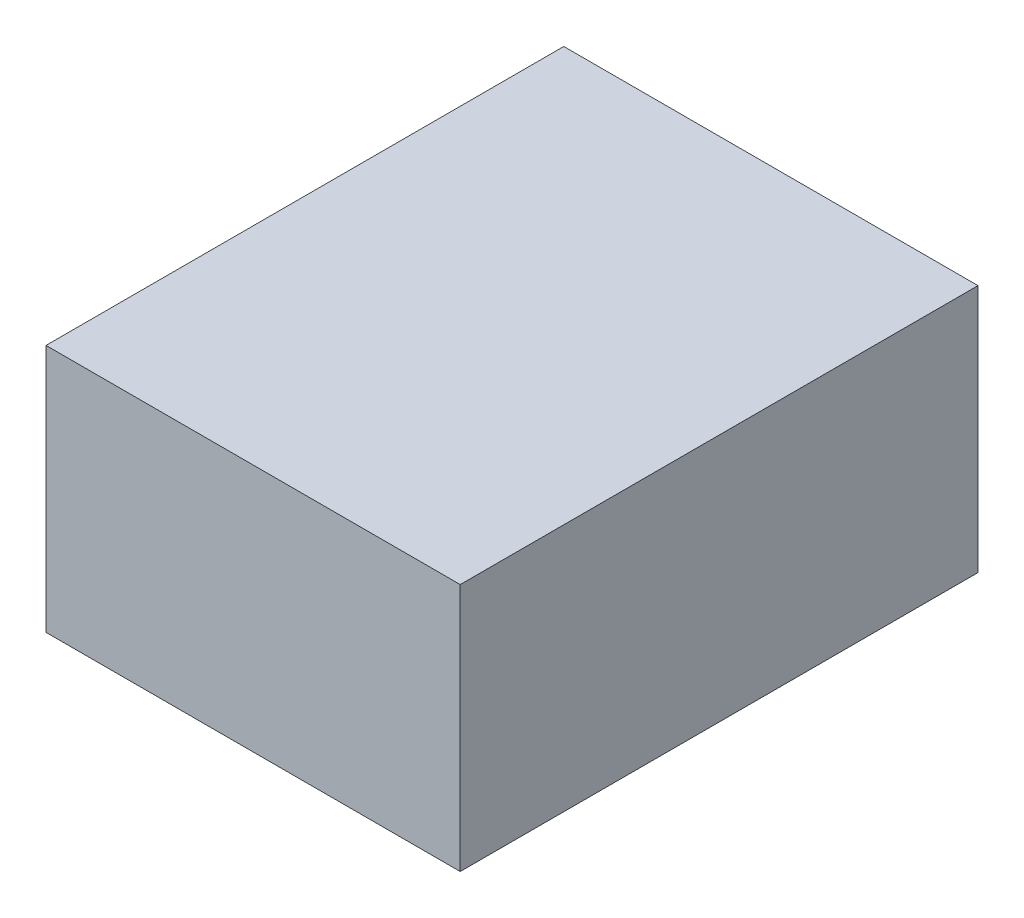
ISO-10303-21;
HEADER;
FILE_DESCRIPTION(('STEP AP214'),'2;1');
FILE_NAME('part.step','',(''),(''),'','','');
FILE_SCHEMA(('AUTOMOTIVE_DESIGN { 1 0 10303 214 1 1 1 1 }'));
ENDSEC;
DATA;
#1=APPLICATION_CONTEXT('core data for automotive mechanical design processes');
#2=APPLICATION_PROTOCOL_DEFINITION('international standard','automotive_design',2000,#1);
#3=PRODUCT_CONTEXT('',#1,'mechanical');
#4=PRODUCT('Part','Part','',(#3));
#5=PRODUCT_RELATED_PRODUCT_CATEGORY('part','',(#4));
#6=PRODUCT_DEFINITION_FORMATION('','',#4);
#7=PRODUCT_DEFINITION_CONTEXT('part definition',#1,'design');
#8=PRODUCT_DEFINITION('design','',#6,#7);
#9=PRODUCT_DEFINITION_SHAPE('','',#8);
#10=(LENGTH_UNIT() NAMED_UNIT(*) SI_UNIT(.MILLI.,.METRE.));
#11=(NAMED_UNIT(*) PLANE_ANGLE_UNIT() SI_UNIT($,.RADIAN.));
#12=(NAMED_UNIT(*) SI_UNIT($,.STERADIAN.) SOLID_ANGLE_UNIT());
#13=UNCERTAINTY_MEASURE_WITH_UNIT(LENGTH_MEASURE(1.E-05),#10,'distance_accuracy_value','');
#14=(GEOMETRIC_REPRESENTATION_CONTEXT(3) GLOBAL_UNCERTAINTY_ASSIGNED_CONTEXT((#13)) GLOBAL_UNIT_ASSIGNED_CONTEXT((#10,
#11,#12)) REPRESENTATION_CONTEXT('',''));
#15=CARTESIAN_POINT('',(0.,0.,0.));
#16=DIRECTION('',(0.,0.,1.));
#17=DIRECTION('',(1.,0.,0.));
#18=AXIS2_PLACEMENT_3D('',#15,#16,#17);
#19=CARTESIAN_POINT('',(1.,1.2,-1.25));
#20=DIRECTION('',(-1.,0.,0.));
#21=DIRECTION('',(0.,0.,1.));
#22=AXIS2_PLACEMENT_3D('',#19,#20,#21);
#23=PLANE('',#22);
#24=DIRECTION('',(0.,0.,-1.));
#25=VECTOR('',#24,1.);
#26=CARTESIAN_POINT('',(1.,0.,-1.25));
#27=LINE('',#26,#25);
#28=CARTESIAN_POINT('',(1.,0.,1.25));
#29=VERTEX_POINT('',#28);
#30=CARTESIAN_POINT('',(1.,0.,-1.25));
#31=VERTEX_POINT('',#30);
#32=EDGE_CURVE('E97',#29,#31,#27,.T.);
#33=ORIENTED_EDGE('',*,*,#32,.T.);
#34=DIRECTION('',(0.,-1.,0.));
#35=VECTOR('',#34,1.);
#36=CARTESIAN_POINT('',(1.,1.2,-1.25));
#37=LINE('',#36,#35);
#38=CARTESIAN_POINT('',(1.,1.2,-1.25));
#39=VERTEX_POINT('',#38);
#40=EDGE_CURVE('E11',#39,#31,#37,.T.);
#41=ORIENTED_EDGE('',*,*,#40,.F.);
#42=DIRECTION('',(0.,0.,-1.));
#43=VECTOR('',#42,1.);
#44=CARTESIAN_POINT('',(1.,1.2,-1.25));
#45=LINE('',#44,#43);
#46=CARTESIAN_POINT('',(1.,1.2,1.25));
#47=VERTEX_POINT('',#46);
#48=EDGE_CURVE('E85',#47,#39,#45,.T.);
#49=ORIENTED_EDGE('',*,*,#48,.F.);
#50=DIRECTION('',(0.,-1.,0.));
#51=VECTOR('',#50,1.);
#52=CARTESIAN_POINT('',(1.,1.2,1.25));
#53=LINE('',#52,#51);
#54=EDGE_CURVE('E93',#47,#29,#53,.T.);
#55=ORIENTED_EDGE('',*,*,#54,.T.);
#56=EDGE_LOOP('',(#33,#41,#49,#55));
#57=FACE_BOUND('',#56,.T.);
#58=ADVANCED_FACE('F34',(#57),#23,.F.);
#59=CARTESIAN_POINT('',(-1.,1.2,-1.25));
#60=DIRECTION('',(0.,0.,1.));
#61=DIRECTION('',(1.,0.,0.));
#62=AXIS2_PLACEMENT_3D('',#59,#60,#61);
#63=PLANE('',#62);
#64=DIRECTION('',(-1.,0.,0.));
#65=VECTOR('',#64,1.);
#66=CARTESIAN_POINT('',(-1.,0.,-1.25));
#67=LINE('',#66,#65);
#68=CARTESIAN_POINT('',(-1.,0.,-1.25));
#69=VERTEX_POINT('',#68);
#70=EDGE_CURVE('E89',#31,#69,#67,.T.);
#71=ORIENTED_EDGE('',*,*,#70,.T.);
#72=DIRECTION('',(0.,-1.,0.));
#73=VECTOR('',#72,1.);
#74=CARTESIAN_POINT('',(-1.,1.2,-1.25));
#75=LINE('',#74,#73);
#76=CARTESIAN_POINT('',(-1.,1.2,-1.25));
#77=VERTEX_POINT('',#76);
#78=EDGE_CURVE('E42',#77,#69,#75,.T.);
#79=ORIENTED_EDGE('',*,*,#78,.F.);
#80=DIRECTION('',(-1.,0.,0.));
#81=VECTOR('',#80,1.);
#82=CARTESIAN_POINT('',(-1.,1.2,-1.25));
#83=LINE('',#82,#81);
#84=EDGE_CURVE('E80',#39,#77,#83,.T.);
#85=ORIENTED_EDGE('',*,*,#84,.F.);
#86=ORIENTED_EDGE('',*,*,#40,.T.);
#87=EDGE_LOOP('',(#71,#79,#85,#86));
#88=FACE_BOUND('',#87,.T.);
#89=ADVANCED_FACE('F88',(#88),#63,.F.);
#90=CARTESIAN_POINT('',(-1.,1.2,-1.25));
#91=DIRECTION('',(1.,0.,0.));
#92=DIRECTION('',(0.,0.,-1.));
#93=AXIS2_PLACEMENT_3D('',#90,#91,#92);
#94=PLANE('',#93);
#95=DIRECTION('',(0.,0.,1.));
#96=VECTOR('',#95,1.);
#97=CARTESIAN_POINT('',(-1.,0.,-1.25));
#98=LINE('',#97,#96);
#99=CARTESIAN_POINT('',(-1.,0.,1.25));
#100=VERTEX_POINT('',#99);
#101=EDGE_CURVE('E67',#69,#100,#98,.T.);
#102=ORIENTED_EDGE('',*,*,#101,.T.);
#103=DIRECTION('',(0.,-1.,0.));
#104=VECTOR('',#103,1.);
#105=CARTESIAN_POINT('',(-1.,1.2,1.25));
#106=LINE('',#105,#104);
#107=CARTESIAN_POINT('',(-1.,1.2,1.25));
#108=VERTEX_POINT('',#107);
#109=EDGE_CURVE('E90',#108,#100,#106,.T.);
#110=ORIENTED_EDGE('',*,*,#109,.F.);
#111=DIRECTION('',(0.,0.,1.));
#112=VECTOR('',#111,1.);
#113=CARTESIAN_POINT('',(-1.,1.2,-1.25));
#114=LINE('',#113,#112);
#115=EDGE_CURVE('E83',#77,#108,#114,.T.);
#116=ORIENTED_EDGE('',*,*,#115,.F.);
#117=ORIENTED_EDGE('',*,*,#78,.T.);
#118=EDGE_LOOP('',(#102,#110,#116,#117));
#119=FACE_BOUND('',#118,.T.);
#120=ADVANCED_FACE('F91',(#119),#94,.F.);
#121=CARTESIAN_POINT('',(-1.,1.2,1.25));
#122=DIRECTION('',(0.,0.,-1.));
#123=DIRECTION('',(-1.,0.,0.));
#124=AXIS2_PLACEMENT_3D('',#121,#122,#123);
#125=PLANE('',#124);
#126=DIRECTION('',(1.,0.,0.));
#127=VECTOR('',#126,1.);
#128=CARTESIAN_POINT('',(-1.,0.,1.25));
#129=LINE('',#128,#127);
#130=EDGE_CURVE('E73',#100,#29,#129,.T.);
#131=ORIENTED_EDGE('',*,*,#130,.T.);
#132=ORIENTED_EDGE('',*,*,#54,.F.);
#133=DIRECTION('',(1.,0.,0.));
#134=VECTOR('',#133,1.);
#135=CARTESIAN_POINT('',(-1.,1.2,1.25));
#136=LINE('',#135,#134);
#137=EDGE_CURVE('E50',#108,#47,#136,.T.);
#138=ORIENTED_EDGE('',*,*,#137,.F.);
#139=ORIENTED_EDGE('',*,*,#109,.T.);
#140=EDGE_LOOP('',(#131,#132,#138,#139));
#141=FACE_BOUND('',#140,.T.);
#142=ADVANCED_FACE('F104',(#141),#125,.F.);
#143=CARTESIAN_POINT('',(0.,1.2,0.));
#144=DIRECTION('',(0.,1.,0.));
#145=DIRECTION('',(0.,0.,1.));
#146=AXIS2_PLACEMENT_3D('',#143,#144,#145);
#147=PLANE('',#146);
#148=ORIENTED_EDGE('',*,*,#48,.T.);
#149=ORIENTED_EDGE('',*,*,#84,.T.);
#150=ORIENTED_EDGE('',*,*,#115,.T.);
#151=ORIENTED_EDGE('',*,*,#137,.T.);
#152=EDGE_LOOP('',(#148,#149,#150,#151));
#153=FACE_BOUND('',#152,.T.);
#154=ADVANCED_FACE('F81',(#153),#147,.T.);
#155=CARTESIAN_POINT('',(0.,0.,0.));
#156=DIRECTION('',(0.,1.,0.));
#157=DIRECTION('',(0.,0.,1.));
#158=AXIS2_PLACEMENT_3D('',#155,#156,#157);
#159=PLANE('',#158);
#160=ORIENTED_EDGE('',*,*,#32,.F.);
#161=ORIENTED_EDGE('',*,*,#130,.F.);
#162=ORIENTED_EDGE('',*,*,#101,.F.);
#163=ORIENTED_EDGE('',*,*,#70,.F.);
#164=EDGE_LOOP('',(#160,#161,#162,#163));
#165=FACE_BOUND('',#164,.T.);
#166=ADVANCED_FACE('F107',(#165),#159,.F.);
#167=CLOSED_SHELL('',(#58,#89,#120,#142,#154,#166));
#168=MANIFOLD_SOLID_BREP('B2',#167);
#169=ADVANCED_BREP_SHAPE_REPRESENTATION('',(#18,#168),#14);
#170=SHAPE_DEFINITION_REPRESENTATION(#9,#169);
ENDSEC;
END-ISO-10303-21;
